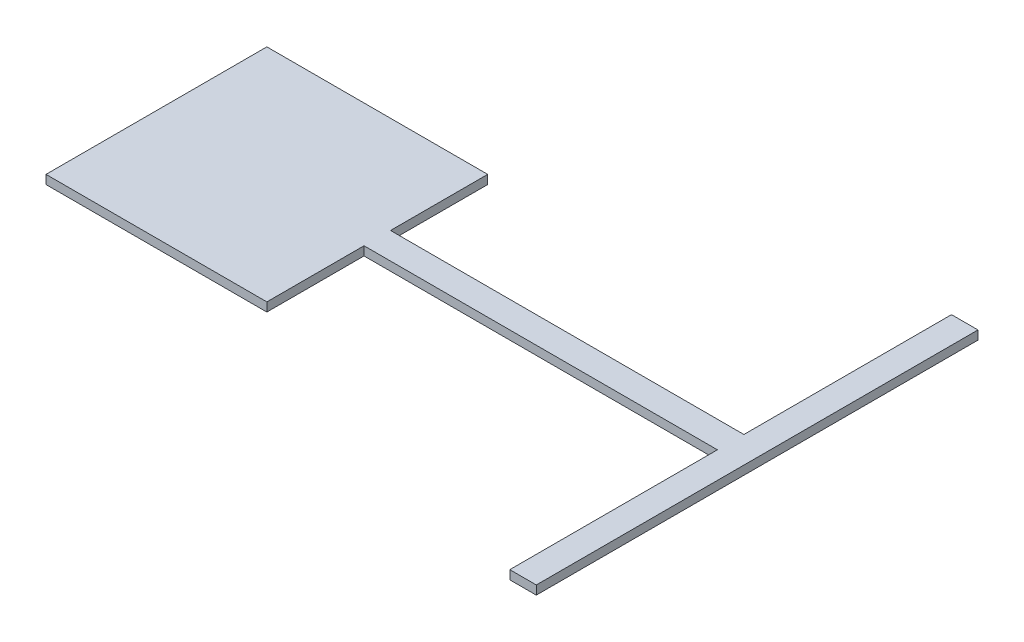
ISO-10303-21;
HEADER;
FILE_DESCRIPTION(('STEP AP214'),'2;1');
FILE_NAME('part.step','',(''),(''),'','','');
FILE_SCHEMA(('AUTOMOTIVE_DESIGN { 1 0 10303 214 1 1 1 1 }'));
ENDSEC;
DATA;
#1=APPLICATION_CONTEXT('core data for automotive mechanical design processes');
#2=APPLICATION_PROTOCOL_DEFINITION('international standard','automotive_design',2000,#1);
#3=PRODUCT_CONTEXT('',#1,'mechanical');
#4=PRODUCT('Part','Part','',(#3));
#5=PRODUCT_RELATED_PRODUCT_CATEGORY('part','',(#4));
#6=PRODUCT_DEFINITION_FORMATION('','',#4);
#7=PRODUCT_DEFINITION_CONTEXT('part definition',#1,'design');
#8=PRODUCT_DEFINITION('design','',#6,#7);
#9=PRODUCT_DEFINITION_SHAPE('','',#8);
#10=(LENGTH_UNIT() NAMED_UNIT(*) SI_UNIT(.MILLI.,.METRE.));
#11=(NAMED_UNIT(*) PLANE_ANGLE_UNIT() SI_UNIT($,.RADIAN.));
#12=(NAMED_UNIT(*) SI_UNIT($,.STERADIAN.) SOLID_ANGLE_UNIT());
#13=UNCERTAINTY_MEASURE_WITH_UNIT(LENGTH_MEASURE(1.E-05),#10,'distance_accuracy_value','');
#14=(GEOMETRIC_REPRESENTATION_CONTEXT(3) GLOBAL_UNCERTAINTY_ASSIGNED_CONTEXT((#13)) GLOBAL_UNIT_ASSIGNED_CONTEXT((#10,
#11,#12)) REPRESENTATION_CONTEXT('',''));
#15=CARTESIAN_POINT('',(0.,0.,0.));
#16=DIRECTION('',(0.,0.,1.));
#17=DIRECTION('',(1.,0.,0.));
#18=AXIS2_PLACEMENT_3D('',#15,#16,#17);
#19=CARTESIAN_POINT('',(-72.674418604651,10.,0.));
#20=DIRECTION('',(1.,0.,0.));
#21=DIRECTION('',(0.,0.,-1.));
#22=AXIS2_PLACEMENT_3D('',#19,#20,#21);
#23=PLANE('',#22);
#24=DIRECTION('',(0.,0.,1.));
#25=VECTOR('',#24,1.);
#26=CARTESIAN_POINT('',(-72.674418604651,0.,0.));
#27=LINE('',#26,#25);
#28=CARTESIAN_POINT('',(-72.674418604651,0.,-141.472868217054));
#29=VERTEX_POINT('',#28);
#30=CARTESIAN_POINT('',(-72.674418604651,0.,-31.4728682170545));
#31=VERTEX_POINT('',#30);
#32=EDGE_CURVE('E152',#29,#31,#27,.T.);
#33=ORIENTED_EDGE('',*,*,#32,.F.);
#34=DIRECTION('',(0.,-1.,0.));
#35=VECTOR('',#34,1.);
#36=CARTESIAN_POINT('',(-72.674418604651,10.,-141.472868217054));
#37=LINE('',#36,#35);
#38=CARTESIAN_POINT('',(-72.674418604651,10.,-141.472868217054));
#39=VERTEX_POINT('',#38);
#40=EDGE_CURVE('E11',#39,#29,#37,.T.);
#41=ORIENTED_EDGE('',*,*,#40,.F.);
#42=DIRECTION('',(0.,0.,1.));
#43=VECTOR('',#42,1.);
#44=CARTESIAN_POINT('',(-72.674418604651,10.,0.));
#45=LINE('',#44,#43);
#46=CARTESIAN_POINT('',(-72.674418604651,10.,-31.4728682170545));
#47=VERTEX_POINT('',#46);
#48=EDGE_CURVE('E178',#39,#47,#45,.T.);
#49=ORIENTED_EDGE('',*,*,#48,.T.);
#50=DIRECTION('',(0.,-1.,0.));
#51=VECTOR('',#50,1.);
#52=CARTESIAN_POINT('',(-72.674418604651,10.,-31.4728682170545));
#53=LINE('',#52,#51);
#54=EDGE_CURVE('E49',#47,#31,#53,.T.);
#55=ORIENTED_EDGE('',*,*,#54,.T.);
#56=EDGE_LOOP('',(#33,#41,#49,#55));
#57=FACE_BOUND('',#56,.T.);
#58=ADVANCED_FACE('F32',(#57),#23,.T.);
#59=CARTESIAN_POINT('',(-3.45546158439536E-13,10.,-141.472868217055));
#60=DIRECTION('',(0.,0.,-1.));
#61=DIRECTION('',(-1.,0.,0.));
#62=AXIS2_PLACEMENT_3D('',#59,#60,#61);
#63=PLANE('',#62);
#64=DIRECTION('',(1.,0.,0.));
#65=VECTOR('',#64,1.);
#66=CARTESIAN_POINT('',(-3.45546158439536E-13,0.,-141.472868217055));
#67=LINE('',#66,#65);
#68=CARTESIAN_POINT('',(-322.674418604651,0.,-141.472868217054));
#69=VERTEX_POINT('',#68);
#70=EDGE_CURVE('E154',#69,#29,#67,.T.);
#71=ORIENTED_EDGE('',*,*,#70,.F.);
#72=DIRECTION('',(0.,-1.,0.));
#73=VECTOR('',#72,1.);
#74=CARTESIAN_POINT('',(-322.674418604651,10.,-141.472868217054));
#75=LINE('',#74,#73);
#76=CARTESIAN_POINT('',(-322.674418604651,10.,-141.472868217054));
#77=VERTEX_POINT('',#76);
#78=EDGE_CURVE('E41',#77,#69,#75,.T.);
#79=ORIENTED_EDGE('',*,*,#78,.F.);
#80=DIRECTION('',(1.,0.,0.));
#81=VECTOR('',#80,1.);
#82=CARTESIAN_POINT('',(-3.45546158439536E-13,10.,-141.472868217055));
#83=LINE('',#82,#81);
#84=EDGE_CURVE('E210',#77,#39,#83,.T.);
#85=ORIENTED_EDGE('',*,*,#84,.T.);
#86=ORIENTED_EDGE('',*,*,#40,.T.);
#87=EDGE_LOOP('',(#71,#79,#85,#86));
#88=FACE_BOUND('',#87,.T.);
#89=ADVANCED_FACE('F34',(#88),#63,.T.);
#90=CARTESIAN_POINT('',(-322.674418604651,10.,0.));
#91=DIRECTION('',(1.,0.,0.));
#92=DIRECTION('',(0.,0.,-1.));
#93=AXIS2_PLACEMENT_3D('',#90,#91,#92);
#94=PLANE('',#93);
#95=DIRECTION('',(0.,0.,1.));
#96=VECTOR('',#95,1.);
#97=CARTESIAN_POINT('',(-322.674418604651,0.,0.));
#98=LINE('',#97,#96);
#99=CARTESIAN_POINT('',(-322.674418604651,0.,108.527131782946));
#100=VERTEX_POINT('',#99);
#101=EDGE_CURVE('E158',#69,#100,#98,.T.);
#102=ORIENTED_EDGE('',*,*,#101,.T.);
#103=DIRECTION('',(0.,-1.,0.));
#104=VECTOR('',#103,1.);
#105=CARTESIAN_POINT('',(-322.674418604651,10.,108.527131782946));
#106=LINE('',#105,#104);
#107=CARTESIAN_POINT('',(-322.674418604651,10.,108.527131782946));
#108=VERTEX_POINT('',#107);
#109=EDGE_CURVE('E194',#108,#100,#106,.T.);
#110=ORIENTED_EDGE('',*,*,#109,.F.);
#111=DIRECTION('',(0.,0.,1.));
#112=VECTOR('',#111,1.);
#113=CARTESIAN_POINT('',(-322.674418604651,10.,0.));
#114=LINE('',#113,#112);
#115=EDGE_CURVE('E201',#77,#108,#114,.T.);
#116=ORIENTED_EDGE('',*,*,#115,.F.);
#117=ORIENTED_EDGE('',*,*,#78,.T.);
#118=EDGE_LOOP('',(#102,#110,#116,#117));
#119=FACE_BOUND('',#118,.T.);
#120=ADVANCED_FACE('F199',(#119),#94,.F.);
#121=CARTESIAN_POINT('',(0.,10.,108.527131782946));
#122=DIRECTION('',(0.,0.,-1.));
#123=DIRECTION('',(-1.,0.,0.));
#124=AXIS2_PLACEMENT_3D('',#121,#122,#123);
#125=PLANE('',#124);
#126=DIRECTION('',(1.,0.,0.));
#127=VECTOR('',#126,1.);
#128=CARTESIAN_POINT('',(0.,0.,108.527131782946));
#129=LINE('',#128,#127);
#130=CARTESIAN_POINT('',(-72.674418604651,0.,108.527131782946));
#131=VERTEX_POINT('',#130);
#132=EDGE_CURVE('E160',#100,#131,#129,.T.);
#133=ORIENTED_EDGE('',*,*,#132,.T.);
#134=DIRECTION('',(0.,-1.,0.));
#135=VECTOR('',#134,1.);
#136=CARTESIAN_POINT('',(-72.674418604651,10.,108.527131782946));
#137=LINE('',#136,#135);
#138=CARTESIAN_POINT('',(-72.674418604651,10.,108.527131782946));
#139=VERTEX_POINT('',#138);
#140=EDGE_CURVE('E192',#139,#131,#137,.T.);
#141=ORIENTED_EDGE('',*,*,#140,.F.);
#142=DIRECTION('',(1.,0.,0.));
#143=VECTOR('',#142,1.);
#144=CARTESIAN_POINT('',(0.,10.,108.527131782946));
#145=LINE('',#144,#143);
#146=EDGE_CURVE('E256',#108,#139,#145,.T.);
#147=ORIENTED_EDGE('',*,*,#146,.F.);
#148=ORIENTED_EDGE('',*,*,#109,.T.);
#149=EDGE_LOOP('',(#133,#141,#147,#148));
#150=FACE_BOUND('',#149,.T.);
#151=ADVANCED_FACE('F232',(#150),#125,.F.);
#152=CARTESIAN_POINT('',(-72.674418604651,0.,-1.47286821705446));
#153=VERTEX_POINT('',#152);
#154=EDGE_CURVE('E155',#153,#131,#27,.T.);
#155=ORIENTED_EDGE('',*,*,#154,.F.);
#156=DIRECTION('',(0.,-1.,0.));
#157=VECTOR('',#156,1.);
#158=CARTESIAN_POINT('',(-72.674418604651,10.,-1.47286821705446));
#159=LINE('',#158,#157);
#160=CARTESIAN_POINT('',(-72.674418604651,10.,-1.47286821705446));
#161=VERTEX_POINT('',#160);
#162=EDGE_CURVE('E190',#161,#153,#159,.T.);
#163=ORIENTED_EDGE('',*,*,#162,.F.);
#164=EDGE_CURVE('E253',#161,#139,#45,.T.);
#165=ORIENTED_EDGE('',*,*,#164,.T.);
#166=ORIENTED_EDGE('',*,*,#140,.T.);
#167=EDGE_LOOP('',(#155,#163,#165,#166));
#168=FACE_BOUND('',#167,.T.);
#169=ADVANCED_FACE('F224',(#168),#23,.T.);
#170=CARTESIAN_POINT('',(0.,10.,-1.47286821705446));
#171=DIRECTION('',(0.,0.,-1.));
#172=DIRECTION('',(-1.,0.,0.));
#173=AXIS2_PLACEMENT_3D('',#170,#171,#172);
#174=PLANE('',#173);
#175=DIRECTION('',(1.,0.,0.));
#176=VECTOR('',#175,1.);
#177=CARTESIAN_POINT('',(0.,0.,-1.47286821705446));
#178=LINE('',#177,#176);
#179=CARTESIAN_POINT('',(327.325581395349,0.,-1.47286821705446));
#180=VERTEX_POINT('',#179);
#181=EDGE_CURVE('E163',#153,#180,#178,.T.);
#182=ORIENTED_EDGE('',*,*,#181,.T.);
#183=DIRECTION('',(0.,-1.,0.));
#184=VECTOR('',#183,1.);
#185=CARTESIAN_POINT('',(327.325581395349,10.,-1.47286821705446));
#186=LINE('',#185,#184);
#187=CARTESIAN_POINT('',(327.325581395349,10.,-1.47286821705446));
#188=VERTEX_POINT('',#187);
#189=EDGE_CURVE('E187',#188,#180,#186,.T.);
#190=ORIENTED_EDGE('',*,*,#189,.F.);
#191=DIRECTION('',(1.,0.,0.));
#192=VECTOR('',#191,1.);
#193=CARTESIAN_POINT('',(0.,10.,-1.47286821705446));
#194=LINE('',#193,#192);
#195=EDGE_CURVE('E252',#161,#188,#194,.T.);
#196=ORIENTED_EDGE('',*,*,#195,.F.);
#197=ORIENTED_EDGE('',*,*,#162,.T.);
#198=EDGE_LOOP('',(#182,#190,#196,#197));
#199=FACE_BOUND('',#198,.T.);
#200=ADVANCED_FACE('F231',(#199),#174,.F.);
#201=CARTESIAN_POINT('',(327.325581395349,10.,0.));
#202=DIRECTION('',(1.,0.,0.));
#203=DIRECTION('',(0.,0.,-1.));
#204=AXIS2_PLACEMENT_3D('',#201,#202,#203);
#205=PLANE('',#204);
#206=DIRECTION('',(0.,0.,1.));
#207=VECTOR('',#206,1.);
#208=CARTESIAN_POINT('',(327.325581395349,0.,0.));
#209=LINE('',#208,#207);
#210=CARTESIAN_POINT('',(327.325581395349,0.,233.527131782946));
#211=VERTEX_POINT('',#210);
#212=EDGE_CURVE('E165',#180,#211,#209,.T.);
#213=ORIENTED_EDGE('',*,*,#212,.T.);
#214=DIRECTION('',(0.,-1.,0.));
#215=VECTOR('',#214,1.);
#216=CARTESIAN_POINT('',(327.325581395349,10.,233.527131782946));
#217=LINE('',#216,#215);
#218=CARTESIAN_POINT('',(327.325581395349,10.,233.527131782946));
#219=VERTEX_POINT('',#218);
#220=EDGE_CURVE('E184',#219,#211,#217,.T.);
#221=ORIENTED_EDGE('',*,*,#220,.F.);
#222=DIRECTION('',(0.,0.,1.));
#223=VECTOR('',#222,1.);
#224=CARTESIAN_POINT('',(327.325581395349,10.,0.));
#225=LINE('',#224,#223);
#226=EDGE_CURVE('E141',#188,#219,#225,.T.);
#227=ORIENTED_EDGE('',*,*,#226,.F.);
#228=ORIENTED_EDGE('',*,*,#189,.T.);
#229=EDGE_LOOP('',(#213,#221,#227,#228));
#230=FACE_BOUND('',#229,.T.);
#231=ADVANCED_FACE('F220',(#230),#205,.F.);
#232=CARTESIAN_POINT('',(0.,10.,233.527131782946));
#233=DIRECTION('',(0.,0.,-1.));
#234=DIRECTION('',(-1.,0.,0.));
#235=AXIS2_PLACEMENT_3D('',#232,#233,#234);
#236=PLANE('',#235);
#237=DIRECTION('',(1.,0.,0.));
#238=VECTOR('',#237,1.);
#239=CARTESIAN_POINT('',(0.,0.,233.527131782946));
#240=LINE('',#239,#238);
#241=CARTESIAN_POINT('',(357.325581395349,0.,233.527131782946));
#242=VERTEX_POINT('',#241);
#243=EDGE_CURVE('E167',#211,#242,#240,.T.);
#244=ORIENTED_EDGE('',*,*,#243,.T.);
#245=DIRECTION('',(0.,-1.,0.));
#246=VECTOR('',#245,1.);
#247=CARTESIAN_POINT('',(357.325581395349,10.,233.527131782946));
#248=LINE('',#247,#246);
#249=CARTESIAN_POINT('',(357.325581395349,10.,233.527131782946));
#250=VERTEX_POINT('',#249);
#251=EDGE_CURVE('E182',#250,#242,#248,.T.);
#252=ORIENTED_EDGE('',*,*,#251,.F.);
#253=DIRECTION('',(1.,0.,0.));
#254=VECTOR('',#253,1.);
#255=CARTESIAN_POINT('',(0.,10.,233.527131782946));
#256=LINE('',#255,#254);
#257=EDGE_CURVE('E147',#219,#250,#256,.T.);
#258=ORIENTED_EDGE('',*,*,#257,.F.);
#259=ORIENTED_EDGE('',*,*,#220,.T.);
#260=EDGE_LOOP('',(#244,#252,#258,#259));
#261=FACE_BOUND('',#260,.T.);
#262=ADVANCED_FACE('F264',(#261),#236,.F.);
#263=CARTESIAN_POINT('',(357.325581395349,10.,0.));
#264=DIRECTION('',(1.,0.,0.));
#265=DIRECTION('',(0.,0.,-1.));
#266=AXIS2_PLACEMENT_3D('',#263,#264,#265);
#267=PLANE('',#266);
#268=DIRECTION('',(0.,0.,1.));
#269=VECTOR('',#268,1.);
#270=CARTESIAN_POINT('',(357.325581395349,0.,0.));
#271=LINE('',#270,#269);
#272=CARTESIAN_POINT('',(357.325581395349,0.,-266.472868217054));
#273=VERTEX_POINT('',#272);
#274=EDGE_CURVE('E171',#273,#242,#271,.T.);
#275=ORIENTED_EDGE('',*,*,#274,.F.);
#276=DIRECTION('',(0.,-1.,0.));
#277=VECTOR('',#276,1.);
#278=CARTESIAN_POINT('',(357.325581395349,10.,-266.472868217054));
#279=LINE('',#278,#277);
#280=CARTESIAN_POINT('',(357.325581395349,10.,-266.472868217054));
#281=VERTEX_POINT('',#280);
#282=EDGE_CURVE('E133',#281,#273,#279,.T.);
#283=ORIENTED_EDGE('',*,*,#282,.F.);
#284=DIRECTION('',(0.,0.,1.));
#285=VECTOR('',#284,1.);
#286=CARTESIAN_POINT('',(357.325581395349,10.,0.));
#287=LINE('',#286,#285);
#288=EDGE_CURVE('E145',#281,#250,#287,.T.);
#289=ORIENTED_EDGE('',*,*,#288,.T.);
#290=ORIENTED_EDGE('',*,*,#251,.T.);
#291=EDGE_LOOP('',(#275,#283,#289,#290));
#292=FACE_BOUND('',#291,.T.);
#293=ADVANCED_FACE('F267',(#292),#267,.T.);
#294=CARTESIAN_POINT('',(4.93073856220799E-13,10.,-266.472868217055));
#295=DIRECTION('',(0.,0.,-1.));
#296=DIRECTION('',(-1.,0.,0.));
#297=AXIS2_PLACEMENT_3D('',#294,#295,#296);
#298=PLANE('',#297);
#299=DIRECTION('',(1.,0.,0.));
#300=VECTOR('',#299,1.);
#301=CARTESIAN_POINT('',(4.93073856220799E-13,0.,-266.472868217055));
#302=LINE('',#301,#300);
#303=CARTESIAN_POINT('',(327.325581395349,0.,-266.472868217054));
#304=VERTEX_POINT('',#303);
#305=EDGE_CURVE('E130',#304,#273,#302,.T.);
#306=ORIENTED_EDGE('',*,*,#305,.F.);
#307=DIRECTION('',(0.,-1.,0.));
#308=VECTOR('',#307,1.);
#309=CARTESIAN_POINT('',(327.325581395349,10.,-266.472868217054));
#310=LINE('',#309,#308);
#311=CARTESIAN_POINT('',(327.325581395349,10.,-266.472868217054));
#312=VERTEX_POINT('',#311);
#313=EDGE_CURVE('E124',#312,#304,#310,.T.);
#314=ORIENTED_EDGE('',*,*,#313,.F.);
#315=DIRECTION('',(1.,0.,0.));
#316=VECTOR('',#315,1.);
#317=CARTESIAN_POINT('',(4.93073856220799E-13,10.,-266.472868217055));
#318=LINE('',#317,#316);
#319=EDGE_CURVE('E128',#312,#281,#318,.T.);
#320=ORIENTED_EDGE('',*,*,#319,.T.);
#321=ORIENTED_EDGE('',*,*,#282,.T.);
#322=EDGE_LOOP('',(#306,#314,#320,#321));
#323=FACE_BOUND('',#322,.T.);
#324=ADVANCED_FACE('F126',(#323),#298,.T.);
#325=CARTESIAN_POINT('',(327.325581395349,0.,-31.4728682170545));
#326=VERTEX_POINT('',#325);
#327=EDGE_CURVE('E168',#304,#326,#209,.T.);
#328=ORIENTED_EDGE('',*,*,#327,.T.);
#329=DIRECTION('',(0.,-1.,0.));
#330=VECTOR('',#329,1.);
#331=CARTESIAN_POINT('',(327.325581395349,10.,-31.4728682170545));
#332=LINE('',#331,#330);
#333=CARTESIAN_POINT('',(327.325581395349,10.,-31.4728682170545));
#334=VERTEX_POINT('',#333);
#335=EDGE_CURVE('E87',#334,#326,#332,.T.);
#336=ORIENTED_EDGE('',*,*,#335,.F.);
#337=EDGE_CURVE('E135',#312,#334,#225,.T.);
#338=ORIENTED_EDGE('',*,*,#337,.F.);
#339=ORIENTED_EDGE('',*,*,#313,.T.);
#340=EDGE_LOOP('',(#328,#336,#338,#339));
#341=FACE_BOUND('',#340,.T.);
#342=ADVANCED_FACE('F136',(#341),#205,.F.);
#343=CARTESIAN_POINT('',(0.,10.,-31.4728682170545));
#344=DIRECTION('',(0.,0.,-1.));
#345=DIRECTION('',(-1.,0.,0.));
#346=AXIS2_PLACEMENT_3D('',#343,#344,#345);
#347=PLANE('',#346);
#348=DIRECTION('',(1.,0.,0.));
#349=VECTOR('',#348,1.);
#350=CARTESIAN_POINT('',(0.,0.,-31.4728682170545));
#351=LINE('',#350,#349);
#352=EDGE_CURVE('E175',#31,#326,#351,.T.);
#353=ORIENTED_EDGE('',*,*,#352,.F.);
#354=ORIENTED_EDGE('',*,*,#54,.F.);
#355=DIRECTION('',(1.,0.,0.));
#356=VECTOR('',#355,1.);
#357=CARTESIAN_POINT('',(0.,10.,-31.4728682170545));
#358=LINE('',#357,#356);
#359=EDGE_CURVE('E139',#47,#334,#358,.T.);
#360=ORIENTED_EDGE('',*,*,#359,.T.);
#361=ORIENTED_EDGE('',*,*,#335,.T.);
#362=EDGE_LOOP('',(#353,#354,#360,#361));
#363=FACE_BOUND('',#362,.T.);
#364=ADVANCED_FACE('F211',(#363),#347,.T.);
#365=CARTESIAN_POINT('',(0.,10.,0.));
#366=DIRECTION('',(0.,1.,0.));
#367=DIRECTION('',(0.,0.,1.));
#368=AXIS2_PLACEMENT_3D('',#365,#366,#367);
#369=PLANE('',#368);
#370=ORIENTED_EDGE('',*,*,#48,.F.);
#371=ORIENTED_EDGE('',*,*,#84,.F.);
#372=ORIENTED_EDGE('',*,*,#115,.T.);
#373=ORIENTED_EDGE('',*,*,#146,.T.);
#374=ORIENTED_EDGE('',*,*,#164,.F.);
#375=ORIENTED_EDGE('',*,*,#195,.T.);
#376=ORIENTED_EDGE('',*,*,#226,.T.);
#377=ORIENTED_EDGE('',*,*,#257,.T.);
#378=ORIENTED_EDGE('',*,*,#288,.F.);
#379=ORIENTED_EDGE('',*,*,#319,.F.);
#380=ORIENTED_EDGE('',*,*,#337,.T.);
#381=ORIENTED_EDGE('',*,*,#359,.F.);
#382=EDGE_LOOP('',(#370,#371,#372,#373,#374,#375,#376,#377,#378,#379,#380,#381));
#383=FACE_BOUND('',#382,.T.);
#384=ADVANCED_FACE('F143',(#383),#369,.T.);
#385=CARTESIAN_POINT('',(0.,0.,0.));
#386=DIRECTION('',(0.,1.,0.));
#387=DIRECTION('',(0.,0.,1.));
#388=AXIS2_PLACEMENT_3D('',#385,#386,#387);
#389=PLANE('',#388);
#390=ORIENTED_EDGE('',*,*,#32,.T.);
#391=ORIENTED_EDGE('',*,*,#352,.T.);
#392=ORIENTED_EDGE('',*,*,#327,.F.);
#393=ORIENTED_EDGE('',*,*,#305,.T.);
#394=ORIENTED_EDGE('',*,*,#274,.T.);
#395=ORIENTED_EDGE('',*,*,#243,.F.);
#396=ORIENTED_EDGE('',*,*,#212,.F.);
#397=ORIENTED_EDGE('',*,*,#181,.F.);
#398=ORIENTED_EDGE('',*,*,#154,.T.);
#399=ORIENTED_EDGE('',*,*,#132,.F.);
#400=ORIENTED_EDGE('',*,*,#101,.F.);
#401=ORIENTED_EDGE('',*,*,#70,.T.);
#402=EDGE_LOOP('',(#390,#391,#392,#393,#394,#395,#396,#397,#398,#399,#400,#401));
#403=FACE_BOUND('',#402,.T.);
#404=ADVANCED_FACE('F208',(#403),#389,.F.);
#405=CLOSED_SHELL('',(#58,#89,#120,#151,#169,#200,#231,#262,#293,#324,#342,#364,#384,#404));
#406=MANIFOLD_SOLID_BREP('B2',#405);
#407=ADVANCED_BREP_SHAPE_REPRESENTATION('',(#18,#406),#14);
#408=SHAPE_DEFINITION_REPRESENTATION(#9,#407);
ENDSEC;
END-ISO-10303-21;
